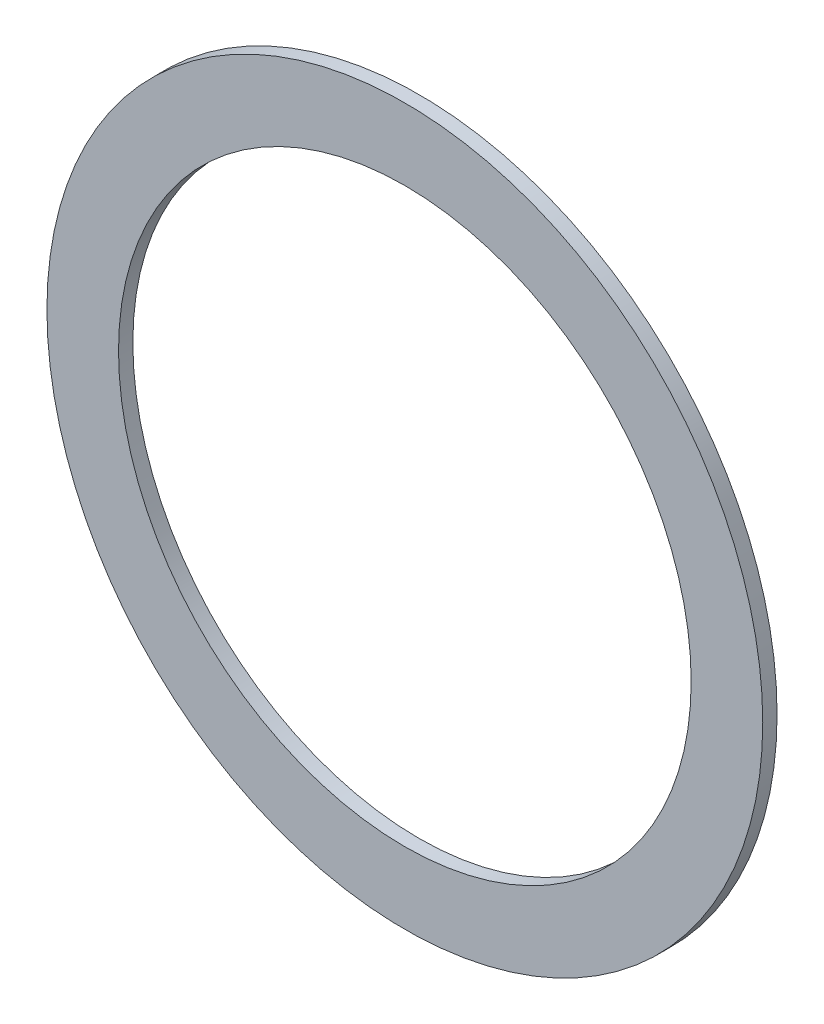
ISO-10303-21;
HEADER;
FILE_DESCRIPTION(('STEP AP214'),'2;1');
FILE_NAME('part.step','',(''),(''),'','','');
FILE_SCHEMA(('AUTOMOTIVE_DESIGN { 1 0 10303 214 1 1 1 1 }'));
ENDSEC;
DATA;
#1=APPLICATION_CONTEXT('core data for automotive mechanical design processes');
#2=APPLICATION_PROTOCOL_DEFINITION('international standard','automotive_design',2000,#1);
#3=PRODUCT_CONTEXT('',#1,'mechanical');
#4=PRODUCT('Part','Part','',(#3));
#5=PRODUCT_RELATED_PRODUCT_CATEGORY('part','',(#4));
#6=PRODUCT_DEFINITION_FORMATION('','',#4);
#7=PRODUCT_DEFINITION_CONTEXT('part definition',#1,'design');
#8=PRODUCT_DEFINITION('design','',#6,#7);
#9=PRODUCT_DEFINITION_SHAPE('','',#8);
#10=(LENGTH_UNIT() NAMED_UNIT(*) SI_UNIT(.MILLI.,.METRE.));
#11=(NAMED_UNIT(*) PLANE_ANGLE_UNIT() SI_UNIT($,.RADIAN.));
#12=(NAMED_UNIT(*) SI_UNIT($,.STERADIAN.) SOLID_ANGLE_UNIT());
#13=UNCERTAINTY_MEASURE_WITH_UNIT(LENGTH_MEASURE(1.E-05),#10,'distance_accuracy_value','');
#14=(GEOMETRIC_REPRESENTATION_CONTEXT(3) GLOBAL_UNCERTAINTY_ASSIGNED_CONTEXT((#13)) GLOBAL_UNIT_ASSIGNED_CONTEXT((#10,
#11,#12)) REPRESENTATION_CONTEXT('',''));
#15=CARTESIAN_POINT('',(0.,0.,0.));
#16=DIRECTION('',(0.,0.,1.));
#17=DIRECTION('',(1.,0.,0.));
#18=AXIS2_PLACEMENT_3D('',#15,#16,#17);
#19=CARTESIAN_POINT('',(0.,0.,1.));
#20=DIRECTION('',(0.,0.,1.));
#21=DIRECTION('',(1.00000000000001,0.,0.));
#22=AXIS2_PLACEMENT_3D('',#19,#20,#21);
#23=PLANE('',#22);
#24=CARTESIAN_POINT('',(0.,0.,1.));
#25=DIRECTION('',(0.,0.,1.));
#26=DIRECTION('',(1.00000000000001,0.,0.));
#27=AXIS2_PLACEMENT_3D('',#24,#25,#26);
#28=CIRCLE('',#27,25.);
#29=CARTESIAN_POINT('',(25.0000000000001,0.,1.));
#30=VERTEX_POINT('',#29);
#31=EDGE_CURVE('E10',#30,#30,#28,.T.);
#32=ORIENTED_EDGE('',*,*,#31,.T.);
#33=EDGE_LOOP('',(#32));
#34=FACE_BOUND('',#33,.T.);
#35=CARTESIAN_POINT('',(0.,0.,1.));
#36=DIRECTION('',(0.,0.,1.));
#37=DIRECTION('',(1.00000000000001,0.,0.));
#38=AXIS2_PLACEMENT_3D('',#35,#36,#37);
#39=CIRCLE('',#38,20.);
#40=CARTESIAN_POINT('',(20.0000000000001,0.,1.));
#41=VERTEX_POINT('',#40);
#42=EDGE_CURVE('E52',#41,#41,#39,.T.);
#43=ORIENTED_EDGE('',*,*,#42,.F.);
#44=EDGE_LOOP('',(#43));
#45=FACE_BOUND('',#44,.T.);
#46=ADVANCED_FACE('F41',(#34,#45),#23,.T.);
#47=CARTESIAN_POINT('',(0.,0.,0.));
#48=DIRECTION('',(0.,0.,1.));
#49=DIRECTION('',(1.00000000000001,0.,0.));
#50=AXIS2_PLACEMENT_3D('',#47,#48,#49);
#51=PLANE('',#50);
#52=CARTESIAN_POINT('',(0.,0.,0.));
#53=DIRECTION('',(0.,0.,1.));
#54=DIRECTION('',(1.00000000000001,0.,0.));
#55=AXIS2_PLACEMENT_3D('',#52,#53,#54);
#56=CIRCLE('',#55,25.);
#57=CARTESIAN_POINT('',(25.0000000000001,0.,0.));
#58=VERTEX_POINT('',#57);
#59=EDGE_CURVE('E45',#58,#58,#56,.T.);
#60=ORIENTED_EDGE('',*,*,#59,.F.);
#61=EDGE_LOOP('',(#60));
#62=FACE_BOUND('',#61,.T.);
#63=CARTESIAN_POINT('',(0.,0.,0.));
#64=DIRECTION('',(0.,0.,1.));
#65=DIRECTION('',(1.00000000000001,0.,0.));
#66=AXIS2_PLACEMENT_3D('',#63,#64,#65);
#67=CIRCLE('',#66,20.);
#68=CARTESIAN_POINT('',(20.0000000000001,0.,0.));
#69=VERTEX_POINT('',#68);
#70=EDGE_CURVE('E54',#69,#69,#67,.T.);
#71=ORIENTED_EDGE('',*,*,#70,.T.);
#72=EDGE_LOOP('',(#71));
#73=FACE_BOUND('',#72,.T.);
#74=ADVANCED_FACE('F64',(#62,#73),#51,.F.);
#75=CARTESIAN_POINT('',(0.,0.,1.));
#76=DIRECTION('',(0.,0.,-1.));
#77=DIRECTION('',(-1.00000000000001,0.,0.));
#78=AXIS2_PLACEMENT_3D('',#75,#76,#77);
#79=CYLINDRICAL_SURFACE('',#78,25.);
#80=ORIENTED_EDGE('',*,*,#31,.F.);
#81=EDGE_LOOP('',(#80));
#82=FACE_BOUND('',#81,.T.);
#83=ORIENTED_EDGE('',*,*,#59,.T.);
#84=EDGE_LOOP('',(#83));
#85=FACE_BOUND('',#84,.T.);
#86=ADVANCED_FACE('F43',(#82,#85),#79,.T.);
#87=CARTESIAN_POINT('',(0.,0.,1.));
#88=DIRECTION('',(0.,0.,-1.));
#89=DIRECTION('',(-1.00000000000001,0.,0.));
#90=AXIS2_PLACEMENT_3D('',#87,#88,#89);
#91=CYLINDRICAL_SURFACE('',#90,20.);
#92=ORIENTED_EDGE('',*,*,#42,.T.);
#93=EDGE_LOOP('',(#92));
#94=FACE_BOUND('',#93,.T.);
#95=ORIENTED_EDGE('',*,*,#70,.F.);
#96=EDGE_LOOP('',(#95));
#97=FACE_BOUND('',#96,.T.);
#98=ADVANCED_FACE('F60',(#94,#97),#91,.F.);
#99=CLOSED_SHELL('',(#46,#74,#86,#98));
#100=MANIFOLD_SOLID_BREP('B2',#99);
#101=ADVANCED_BREP_SHAPE_REPRESENTATION('',(#18,#100),#14);
#102=SHAPE_DEFINITION_REPRESENTATION(#9,#101);
ENDSEC;
END-ISO-10303-21;
